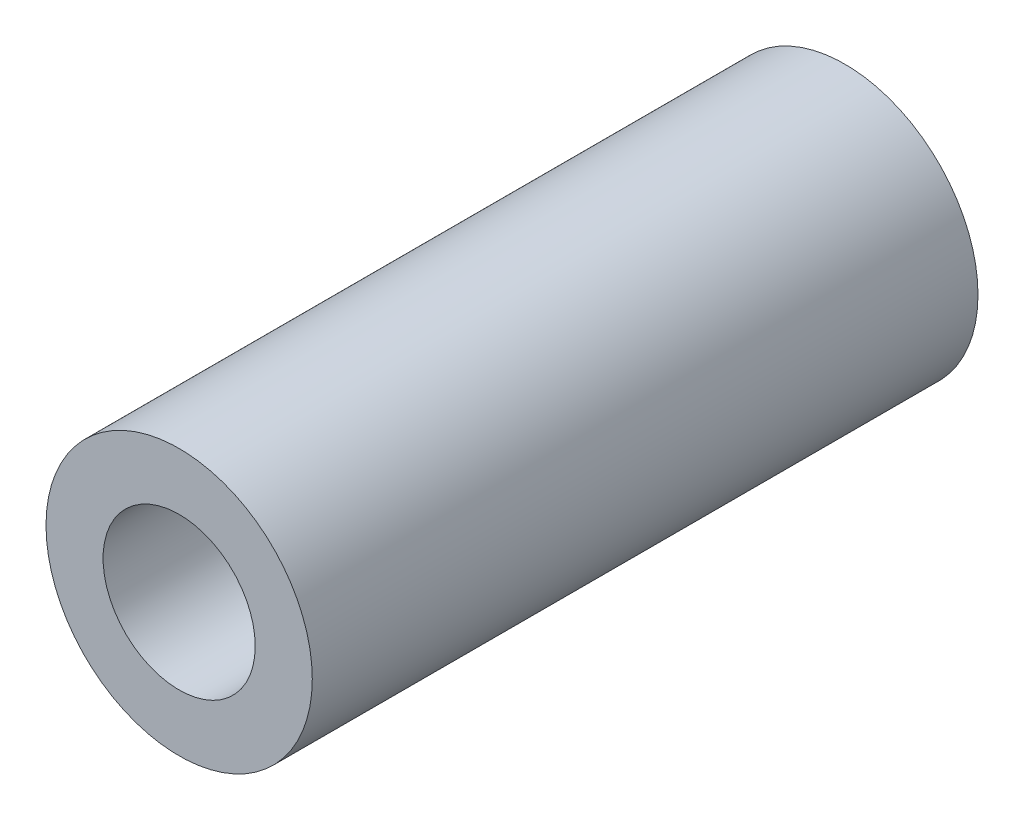
ISO-10303-21;
HEADER;
FILE_DESCRIPTION(('STEP AP214'),'2;1');
FILE_NAME('part.step','',(''),(''),'','','');
FILE_SCHEMA(('AUTOMOTIVE_DESIGN { 1 0 10303 214 1 1 1 1 }'));
ENDSEC;
DATA;
#1=APPLICATION_CONTEXT('core data for automotive mechanical design processes');
#2=APPLICATION_PROTOCOL_DEFINITION('international standard','automotive_design',2000,#1);
#3=PRODUCT_CONTEXT('',#1,'mechanical');
#4=PRODUCT('Part','Part','',(#3));
#5=PRODUCT_RELATED_PRODUCT_CATEGORY('part','',(#4));
#6=PRODUCT_DEFINITION_FORMATION('','',#4);
#7=PRODUCT_DEFINITION_CONTEXT('part definition',#1,'design');
#8=PRODUCT_DEFINITION('design','',#6,#7);
#9=PRODUCT_DEFINITION_SHAPE('','',#8);
#10=(LENGTH_UNIT() NAMED_UNIT(*) SI_UNIT(.MILLI.,.METRE.));
#11=(NAMED_UNIT(*) PLANE_ANGLE_UNIT() SI_UNIT($,.RADIAN.));
#12=(NAMED_UNIT(*) SI_UNIT($,.STERADIAN.) SOLID_ANGLE_UNIT());
#13=UNCERTAINTY_MEASURE_WITH_UNIT(LENGTH_MEASURE(1.E-05),#10,'distance_accuracy_value','');
#14=(GEOMETRIC_REPRESENTATION_CONTEXT(3) GLOBAL_UNCERTAINTY_ASSIGNED_CONTEXT((#13)) GLOBAL_UNIT_ASSIGNED_CONTEXT((#10,
#11,#12)) REPRESENTATION_CONTEXT('',''));
#15=CARTESIAN_POINT('',(0.,0.,0.));
#16=DIRECTION('',(0.,0.,1.));
#17=DIRECTION('',(1.,0.,0.));
#18=AXIS2_PLACEMENT_3D('',#15,#16,#17);
#19=CARTESIAN_POINT('',(0.,0.,35.));
#20=DIRECTION('',(0.,0.,1.));
#21=DIRECTION('',(1.,0.,0.));
#22=AXIS2_PLACEMENT_3D('',#19,#20,#21);
#23=PLANE('',#22);
#24=CARTESIAN_POINT('',(0.,0.,35.));
#25=DIRECTION('',(0.,0.,1.));
#26=DIRECTION('',(1.,0.,0.));
#27=AXIS2_PLACEMENT_3D('',#24,#25,#26);
#28=CIRCLE('',#27,7.);
#29=CARTESIAN_POINT('',(7.,0.,35.));
#30=VERTEX_POINT('',#29);
#31=EDGE_CURVE('E10',#30,#30,#28,.T.);
#32=ORIENTED_EDGE('',*,*,#31,.T.);
#33=EDGE_LOOP('',(#32));
#34=FACE_BOUND('',#33,.T.);
#35=CARTESIAN_POINT('',(0.,0.,35.));
#36=DIRECTION('',(0.,0.,1.));
#37=DIRECTION('',(1.,0.,0.));
#38=AXIS2_PLACEMENT_3D('',#35,#36,#37);
#39=CIRCLE('',#38,4.);
#40=CARTESIAN_POINT('',(4.,0.,35.));
#41=VERTEX_POINT('',#40);
#42=EDGE_CURVE('E43',#41,#41,#39,.T.);
#43=ORIENTED_EDGE('',*,*,#42,.F.);
#44=EDGE_LOOP('',(#43));
#45=FACE_BOUND('',#44,.T.);
#46=ADVANCED_FACE('F32',(#34,#45),#23,.T.);
#47=CARTESIAN_POINT('',(0.,0.,0.));
#48=DIRECTION('',(0.,0.,1.));
#49=DIRECTION('',(1.,0.,0.));
#50=AXIS2_PLACEMENT_3D('',#47,#48,#49);
#51=PLANE('',#50);
#52=CARTESIAN_POINT('',(0.,0.,0.));
#53=DIRECTION('',(0.,0.,1.));
#54=DIRECTION('',(1.,0.,0.));
#55=AXIS2_PLACEMENT_3D('',#52,#53,#54);
#56=CIRCLE('',#55,7.);
#57=CARTESIAN_POINT('',(7.,0.,0.));
#58=VERTEX_POINT('',#57);
#59=EDGE_CURVE('E36',#58,#58,#56,.T.);
#60=ORIENTED_EDGE('',*,*,#59,.F.);
#61=EDGE_LOOP('',(#60));
#62=FACE_BOUND('',#61,.T.);
#63=CARTESIAN_POINT('',(0.,0.,0.));
#64=DIRECTION('',(0.,0.,1.));
#65=DIRECTION('',(1.,0.,0.));
#66=AXIS2_PLACEMENT_3D('',#63,#64,#65);
#67=CIRCLE('',#66,4.);
#68=CARTESIAN_POINT('',(4.,0.,0.));
#69=VERTEX_POINT('',#68);
#70=EDGE_CURVE('E45',#69,#69,#67,.T.);
#71=ORIENTED_EDGE('',*,*,#70,.T.);
#72=EDGE_LOOP('',(#71));
#73=FACE_BOUND('',#72,.T.);
#74=ADVANCED_FACE('F55',(#62,#73),#51,.F.);
#75=CARTESIAN_POINT('',(0.,0.,35.));
#76=DIRECTION('',(0.,0.,-1.));
#77=DIRECTION('',(-1.,0.,0.));
#78=AXIS2_PLACEMENT_3D('',#75,#76,#77);
#79=CYLINDRICAL_SURFACE('',#78,7.);
#80=ORIENTED_EDGE('',*,*,#31,.F.);
#81=EDGE_LOOP('',(#80));
#82=FACE_BOUND('',#81,.T.);
#83=ORIENTED_EDGE('',*,*,#59,.T.);
#84=EDGE_LOOP('',(#83));
#85=FACE_BOUND('',#84,.T.);
#86=ADVANCED_FACE('F34',(#82,#85),#79,.T.);
#87=CARTESIAN_POINT('',(0.,0.,35.));
#88=DIRECTION('',(0.,0.,-1.));
#89=DIRECTION('',(-1.,0.,0.));
#90=AXIS2_PLACEMENT_3D('',#87,#88,#89);
#91=CYLINDRICAL_SURFACE('',#90,4.);
#92=ORIENTED_EDGE('',*,*,#42,.T.);
#93=EDGE_LOOP('',(#92));
#94=FACE_BOUND('',#93,.T.);
#95=ORIENTED_EDGE('',*,*,#70,.F.);
#96=EDGE_LOOP('',(#95));
#97=FACE_BOUND('',#96,.T.);
#98=ADVANCED_FACE('F51',(#94,#97),#91,.F.);
#99=CLOSED_SHELL('',(#46,#74,#86,#98));
#100=MANIFOLD_SOLID_BREP('B2',#99);
#101=ADVANCED_BREP_SHAPE_REPRESENTATION('',(#18,#100),#14);
#102=SHAPE_DEFINITION_REPRESENTATION(#9,#101);
ENDSEC;
END-ISO-10303-21;
